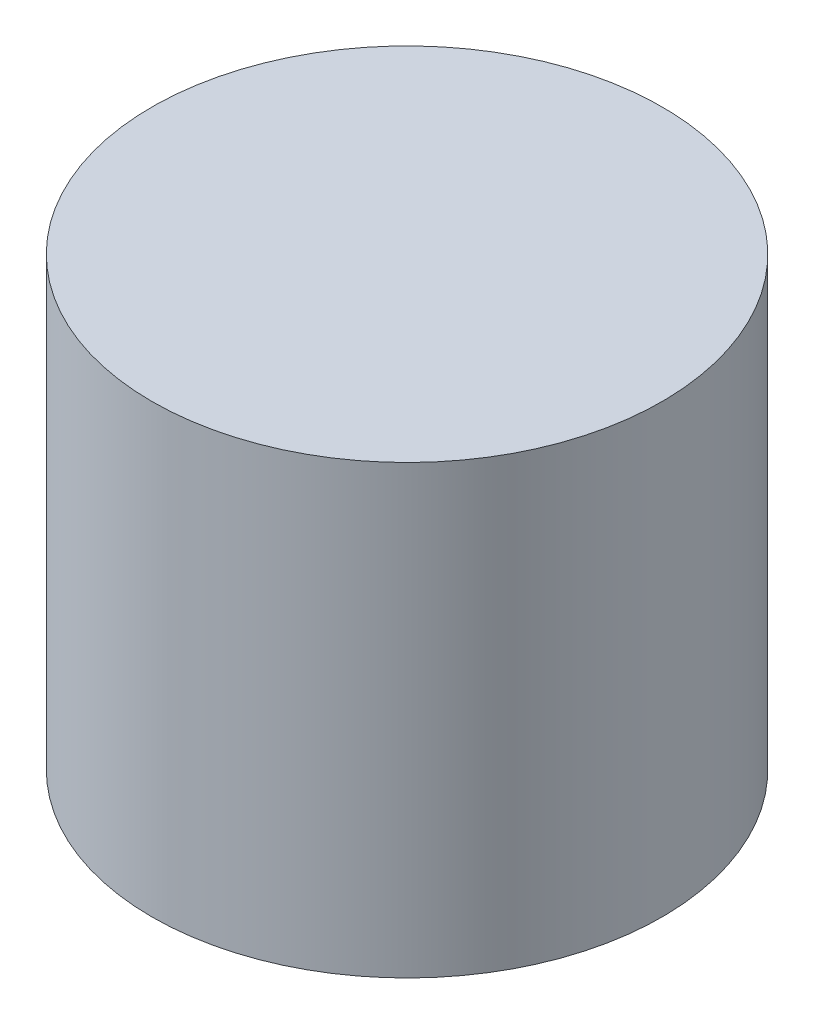
ISO-10303-21;
HEADER;
FILE_DESCRIPTION(('STEP AP214'),'2;1');
FILE_NAME('part.step','',(''),(''),'','','');
FILE_SCHEMA(('AUTOMOTIVE_DESIGN { 1 0 10303 214 1 1 1 1 }'));
ENDSEC;
DATA;
#1=APPLICATION_CONTEXT('core data for automotive mechanical design processes');
#2=APPLICATION_PROTOCOL_DEFINITION('international standard','automotive_design',2000,#1);
#3=PRODUCT_CONTEXT('',#1,'mechanical');
#4=PRODUCT('Part','Part','',(#3));
#5=PRODUCT_RELATED_PRODUCT_CATEGORY('part','',(#4));
#6=PRODUCT_DEFINITION_FORMATION('','',#4);
#7=PRODUCT_DEFINITION_CONTEXT('part definition',#1,'design');
#8=PRODUCT_DEFINITION('design','',#6,#7);
#9=PRODUCT_DEFINITION_SHAPE('','',#8);
#10=(LENGTH_UNIT() NAMED_UNIT(*) SI_UNIT(.MILLI.,.METRE.));
#11=(NAMED_UNIT(*) PLANE_ANGLE_UNIT() SI_UNIT($,.RADIAN.));
#12=(NAMED_UNIT(*) SI_UNIT($,.STERADIAN.) SOLID_ANGLE_UNIT());
#13=UNCERTAINTY_MEASURE_WITH_UNIT(LENGTH_MEASURE(1.E-05),#10,'distance_accuracy_value','');
#14=(GEOMETRIC_REPRESENTATION_CONTEXT(3) GLOBAL_UNCERTAINTY_ASSIGNED_CONTEXT((#13)) GLOBAL_UNIT_ASSIGNED_CONTEXT((#10,
#11,#12)) REPRESENTATION_CONTEXT('',''));
#15=CARTESIAN_POINT('',(0.,0.,0.));
#16=DIRECTION('',(0.,0.,1.));
#17=DIRECTION('',(1.,0.,0.));
#18=AXIS2_PLACEMENT_3D('',#15,#16,#17);
#19=CARTESIAN_POINT('',(-1.10225468832021,7.,-0.343154761458178));
#20=DIRECTION('',(0.,-1.,0.));
#21=DIRECTION('',(0.,0.,-1.));
#22=AXIS2_PLACEMENT_3D('',#19,#20,#21);
#23=CYLINDRICAL_SURFACE('',#22,4.);
#24=CARTESIAN_POINT('',(-1.10225468832021,7.,-0.343154761458178));
#25=DIRECTION('',(0.,1.,0.));
#26=DIRECTION('',(0.,0.,1.));
#27=AXIS2_PLACEMENT_3D('',#24,#25,#26);
#28=CIRCLE('',#27,4.);
#29=CARTESIAN_POINT('',(-1.10225468832021,7.,3.65684523854182));
#30=VERTEX_POINT('',#29);
#31=EDGE_CURVE('E10',#30,#30,#28,.T.);
#32=ORIENTED_EDGE('',*,*,#31,.F.);
#33=EDGE_LOOP('',(#32));
#34=FACE_BOUND('',#33,.T.);
#35=CARTESIAN_POINT('',(-1.10225468832021,0.,-0.343154761458178));
#36=DIRECTION('',(0.,1.,0.));
#37=DIRECTION('',(0.,0.,1.));
#38=AXIS2_PLACEMENT_3D('',#35,#36,#37);
#39=CIRCLE('',#38,4.);
#40=CARTESIAN_POINT('',(-1.10225468832021,0.,3.65684523854182));
#41=VERTEX_POINT('',#40);
#42=EDGE_CURVE('E46',#41,#41,#39,.T.);
#43=ORIENTED_EDGE('',*,*,#42,.T.);
#44=EDGE_LOOP('',(#43));
#45=FACE_BOUND('',#44,.T.);
#46=ADVANCED_FACE('F43',(#34,#45),#23,.T.);
#47=CARTESIAN_POINT('',(-1.10225468832021,7.,-0.343154761458178));
#48=DIRECTION('',(0.,1.,0.));
#49=DIRECTION('',(0.,0.,1.));
#50=AXIS2_PLACEMENT_3D('',#47,#48,#49);
#51=PLANE('',#50);
#52=ORIENTED_EDGE('',*,*,#31,.T.);
#53=EDGE_LOOP('',(#52));
#54=FACE_BOUND('',#53,.T.);
#55=ADVANCED_FACE('F60',(#54),#51,.T.);
#56=CARTESIAN_POINT('',(-1.10225468832021,0.,-0.343154761458178));
#57=DIRECTION('',(0.,1.,0.));
#58=DIRECTION('',(0.,0.,1.));
#59=AXIS2_PLACEMENT_3D('',#56,#57,#58);
#60=PLANE('',#59);
#61=ORIENTED_EDGE('',*,*,#42,.F.);
#62=EDGE_LOOP('',(#61));
#63=FACE_BOUND('',#62,.T.);
#64=ADVANCED_FACE('F58',(#63),#60,.F.);
#65=CLOSED_SHELL('',(#46,#55,#64));
#66=MANIFOLD_SOLID_BREP('B2',#65);
#67=ADVANCED_BREP_SHAPE_REPRESENTATION('',(#18,#66),#14);
#68=SHAPE_DEFINITION_REPRESENTATION(#9,#67);
ENDSEC;
END-ISO-10303-21;
